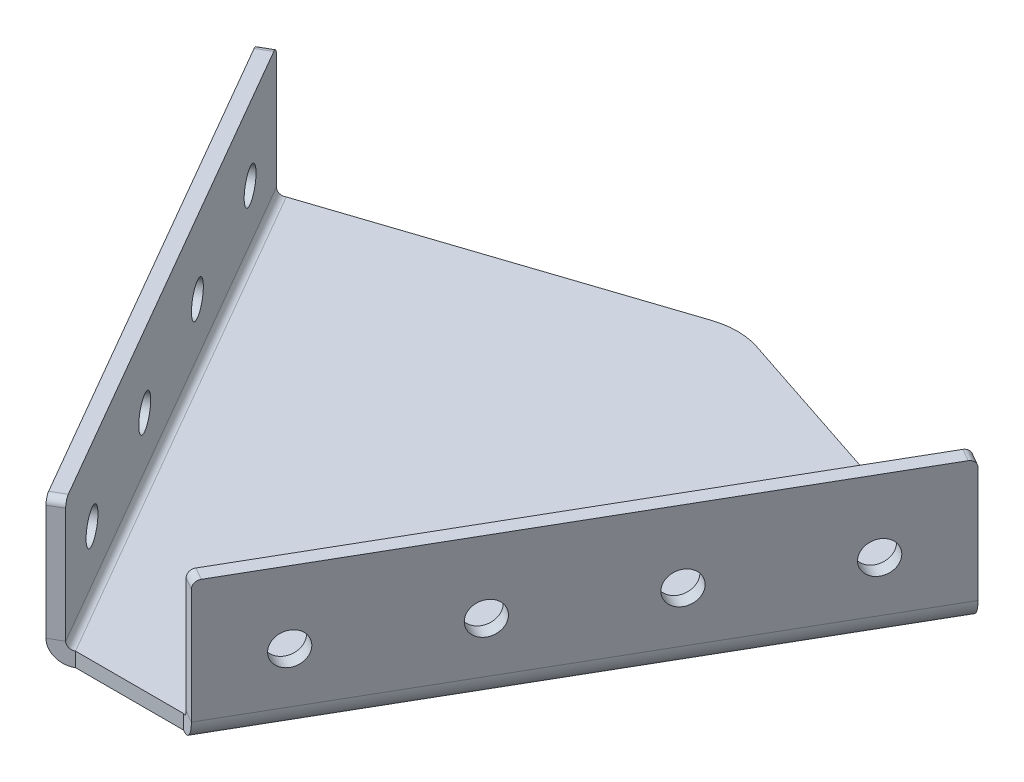
ISO-10303-21;
HEADER;
FILE_DESCRIPTION(('STEP AP214'),'2;1');
FILE_NAME('part.step','',(''),(''),'','','');
FILE_SCHEMA(('AUTOMOTIVE_DESIGN { 1 0 10303 214 1 1 1 1 }'));
ENDSEC;
DATA;
#1=APPLICATION_CONTEXT('core data for automotive mechanical design processes');
#2=APPLICATION_PROTOCOL_DEFINITION('international standard','automotive_design',2000,#1);
#3=PRODUCT_CONTEXT('',#1,'mechanical');
#4=PRODUCT('Part','Part','',(#3));
#5=PRODUCT_RELATED_PRODUCT_CATEGORY('part','',(#4));
#6=PRODUCT_DEFINITION_FORMATION('','',#4);
#7=PRODUCT_DEFINITION_CONTEXT('part definition',#1,'design');
#8=PRODUCT_DEFINITION('design','',#6,#7);
#9=PRODUCT_DEFINITION_SHAPE('','',#8);
#10=(LENGTH_UNIT() NAMED_UNIT(*) SI_UNIT(.MILLI.,.METRE.));
#11=(NAMED_UNIT(*) PLANE_ANGLE_UNIT() SI_UNIT($,.RADIAN.));
#12=(NAMED_UNIT(*) SI_UNIT($,.STERADIAN.) SOLID_ANGLE_UNIT());
#13=UNCERTAINTY_MEASURE_WITH_UNIT(LENGTH_MEASURE(1.E-05),#10,'distance_accuracy_value','');
#14=(GEOMETRIC_REPRESENTATION_CONTEXT(3) GLOBAL_UNCERTAINTY_ASSIGNED_CONTEXT((#13)) GLOBAL_UNIT_ASSIGNED_CONTEXT((#10,
#11,#12)) REPRESENTATION_CONTEXT('',''));
#15=CARTESIAN_POINT('',(0.,0.,0.));
#16=DIRECTION('',(0.,0.,1.));
#17=DIRECTION('',(1.,0.,0.));
#18=AXIS2_PLACEMENT_3D('',#15,#16,#17);
#19=CARTESIAN_POINT('',(95.0767084493342,-13.2391601562485,-55.5973349576684));
#20=DIRECTION('',(-0.314151799048904,0.,0.949372765121444));
#21=DIRECTION('',(-0.949372765121444,0.,-0.314151799048904));
#22=AXIS2_PLACEMENT_3D('',#19,#20,#21);
#23=PLANE('',#22);
#24=DIRECTION('',(-0.949372765121444,0.,-0.314151799048904));
#25=VECTOR('',#24,1.);
#26=CARTESIAN_POINT('',(95.0767084493342,-17.2391601562485,-55.5973349576684));
#27=LINE('',#26,#25);
#28=CARTESIAN_POINT('',(95.0767084493341,-17.2391601562485,-55.5973349576684));
#29=VERTEX_POINT('',#28);
#30=CARTESIAN_POINT('',(6.35974443031255,-17.2391601562485,-84.9541849502709));
#31=VERTEX_POINT('',#30);
#32=EDGE_CURVE('E259',#29,#31,#27,.T.);
#33=ORIENTED_EDGE('',*,*,#32,.T.);
#34=DIRECTION('',(0.,-1.,0.));
#35=VECTOR('',#34,1.);
#36=CARTESIAN_POINT('',(6.35974443031256,-13.2391601562485,-84.9541849502709));
#37=LINE('',#36,#35);
#38=CARTESIAN_POINT('',(6.35974443031255,-13.2391601562485,-84.9541849502709));
#39=VERTEX_POINT('',#38);
#40=EDGE_CURVE('E272',#31,#39,#37,.F.);
#41=ORIENTED_EDGE('',*,*,#40,.T.);
#42=DIRECTION('',(-0.949372765121444,0.,-0.314151799048904));
#43=VECTOR('',#42,1.);
#44=CARTESIAN_POINT('',(95.0767084493342,-13.2391601562485,-55.5973349576684));
#45=LINE('',#44,#43);
#46=CARTESIAN_POINT('',(95.0767084493342,-13.2391601562485,-55.5973349576684));
#47=VERTEX_POINT('',#46);
#48=EDGE_CURVE('E249',#47,#39,#45,.T.);
#49=ORIENTED_EDGE('',*,*,#48,.F.);
#50=DIRECTION('',(0.,1.,0.));
#51=VECTOR('',#50,1.);
#52=CARTESIAN_POINT('',(95.0767084493342,-13.2391601562485,-55.5973349576684));
#53=LINE('',#52,#51);
#54=EDGE_CURVE('E268',#29,#47,#53,.T.);
#55=ORIENTED_EDGE('',*,*,#54,.F.);
#56=EDGE_LOOP('',(#33,#41,#49,#55));
#57=FACE_BOUND('',#56,.T.);
#58=ADVANCED_FACE('F16',(#57),#23,.F.);
#59=CARTESIAN_POINT('',(0.0767084493344949,-13.2391601562485,-87.0332703521581));
#60=DIRECTION('',(0.314151799048904,0.,0.949372765121445));
#61=DIRECTION('',(-0.949372765121444,0.,0.314151799048904));
#62=AXIS2_PLACEMENT_3D('',#59,#60,#61);
#63=PLANE('',#62);
#64=DIRECTION('',(-0.949372765121444,0.,0.314151799048904));
#65=VECTOR('',#64,1.);
#66=CARTESIAN_POINT('',(0.0767084493344949,-13.2391601562485,-87.0332703521581));
#67=LINE('',#66,#65);
#68=CARTESIAN_POINT('',(-6.20632753164357,-13.2391601562485,-84.9541849502709));
#69=VERTEX_POINT('',#68);
#70=CARTESIAN_POINT('',(-94.9232915506651,-13.2391601562485,-55.5973349576684));
#71=VERTEX_POINT('',#70);
#72=EDGE_CURVE('E252',#69,#71,#67,.T.);
#73=ORIENTED_EDGE('',*,*,#72,.F.);
#74=DIRECTION('',(0.,-1.,0.));
#75=VECTOR('',#74,1.);
#76=CARTESIAN_POINT('',(-6.20632753164357,-13.2391601562485,-84.9541849502709));
#77=LINE('',#76,#75);
#78=CARTESIAN_POINT('',(-6.20632753164357,-17.2391601562485,-84.9541849502709));
#79=VERTEX_POINT('',#78);
#80=EDGE_CURVE('E279',#69,#79,#77,.T.);
#81=ORIENTED_EDGE('',*,*,#80,.T.);
#82=DIRECTION('',(-0.949372765121444,0.,0.314151799048904));
#83=VECTOR('',#82,1.);
#84=CARTESIAN_POINT('',(0.0767084493344949,-17.2391601562485,-87.0332703521581));
#85=LINE('',#84,#83);
#86=CARTESIAN_POINT('',(-94.9232915506651,-17.2391601562485,-55.5973349576684));
#87=VERTEX_POINT('',#86);
#88=EDGE_CURVE('E244',#79,#87,#85,.T.);
#89=ORIENTED_EDGE('',*,*,#88,.T.);
#90=DIRECTION('',(0.,1.,0.));
#91=VECTOR('',#90,1.);
#92=CARTESIAN_POINT('',(-94.9232915506651,-13.2391601562485,-55.5973349576684));
#93=LINE('',#92,#91);
#94=EDGE_CURVE('E265',#87,#71,#93,.T.);
#95=ORIENTED_EDGE('',*,*,#94,.T.);
#96=EDGE_LOOP('',(#73,#81,#89,#95));
#97=FACE_BOUND('',#96,.T.);
#98=ADVANCED_FACE('F389',(#97),#63,.F.);
#99=CARTESIAN_POINT('',(-14.9232915506655,-13.2391601562485,82.9667296478419));
#100=DIRECTION('',(0.,0.,-1.));
#101=DIRECTION('',(1.,0.,0.));
#102=AXIS2_PLACEMENT_3D('',#99,#100,#101);
#103=PLANE('',#102);
#104=DIRECTION('',(1.,0.,0.));
#105=VECTOR('',#104,1.);
#106=CARTESIAN_POINT('',(0.0767084493344949,-17.2391601562485,82.9667296478419));
#107=LINE('',#106,#105);
#108=CARTESIAN_POINT('',(-14.9232915506655,-17.2391601562484,82.966729647842));
#109=VERTEX_POINT('',#108);
#110=CARTESIAN_POINT('',(15.0767084493345,-17.2391601562485,82.9667296478419));
#111=VERTEX_POINT('',#110);
#112=EDGE_CURVE('E257',#109,#111,#107,.T.);
#113=ORIENTED_EDGE('',*,*,#112,.T.);
#114=DIRECTION('',(0.,1.,0.));
#115=VECTOR('',#114,1.);
#116=CARTESIAN_POINT('',(15.0767084493345,-13.2391601562485,82.9667296478419));
#117=LINE('',#116,#115);
#118=CARTESIAN_POINT('',(15.0767084493345,-13.2391601562485,82.9667296478419));
#119=VERTEX_POINT('',#118);
#120=EDGE_CURVE('E270',#111,#119,#117,.T.);
#121=ORIENTED_EDGE('',*,*,#120,.T.);
#122=DIRECTION('',(1.,0.,0.));
#123=VECTOR('',#122,1.);
#124=CARTESIAN_POINT('',(-14.9232915506655,-13.2391601562485,82.9667296478419));
#125=LINE('',#124,#123);
#126=CARTESIAN_POINT('',(-14.9232915506655,-13.2391601562485,82.9667296478419));
#127=VERTEX_POINT('',#126);
#128=EDGE_CURVE('E243',#127,#119,#125,.T.);
#129=ORIENTED_EDGE('',*,*,#128,.F.);
#130=DIRECTION('',(0.,1.,0.));
#131=VECTOR('',#130,1.);
#132=CARTESIAN_POINT('',(-14.9232915506655,-13.2391601562485,82.9667296478419));
#133=LINE('',#132,#131);
#134=EDGE_CURVE('E254',#109,#127,#133,.T.);
#135=ORIENTED_EDGE('',*,*,#134,.F.);
#136=EDGE_LOOP('',(#113,#121,#129,#135));
#137=FACE_BOUND('',#136,.T.);
#138=ADVANCED_FACE('F352',(#137),#103,.F.);
#139=CARTESIAN_POINT('',(0.0767084493344949,-13.2391601562485,82.9667296478419));
#140=DIRECTION('',(0.,-1.,0.));
#141=DIRECTION('',(0.,0.,-1.));
#142=AXIS2_PLACEMENT_3D('',#139,#140,#141);
#143=PLANE('',#142);
#144=ORIENTED_EDGE('',*,*,#48,.T.);
#145=CARTESIAN_POINT('',(0.0767084493345088,-13.2391601562485,-65.966729647842));
#146=DIRECTION('',(0.,-1.,0.));
#147=DIRECTION('',(0.,0.,-1.));
#148=AXIS2_PLACEMENT_3D('',#145,#146,#147);
#149=CIRCLE('',#148,20.);
#150=EDGE_CURVE('E277',#39,#69,#149,.F.);
#151=ORIENTED_EDGE('',*,*,#150,.T.);
#152=ORIENTED_EDGE('',*,*,#72,.T.);
#153=DIRECTION('',(0.499999999999998,0.,0.86602540378444));
#154=VECTOR('',#153,1.);
#155=CARTESIAN_POINT('',(-94.9232915506651,-13.2391601562485,-55.5973349576684));
#156=LINE('',#155,#154);
#157=EDGE_CURVE('E241',#71,#127,#156,.T.);
#158=ORIENTED_EDGE('',*,*,#157,.T.);
#159=ORIENTED_EDGE('',*,*,#128,.T.);
#160=DIRECTION('',(0.499999999999998,0.,-0.86602540378444));
#161=VECTOR('',#160,1.);
#162=CARTESIAN_POINT('',(15.0767084493345,-13.2391601562485,82.9667296478419));
#163=LINE('',#162,#161);
#164=EDGE_CURVE('E247',#119,#47,#163,.T.);
#165=ORIENTED_EDGE('',*,*,#164,.T.);
#166=EDGE_LOOP('',(#144,#151,#152,#158,#159,#165));
#167=FACE_BOUND('',#166,.T.);
#168=ADVANCED_FACE('F347',(#167),#143,.F.);
#169=CARTESIAN_POINT('',(0.0767084493344949,-17.2391601562485,82.9667296478419));
#170=DIRECTION('',(0.,-1.,0.));
#171=DIRECTION('',(0.,0.,-1.));
#172=AXIS2_PLACEMENT_3D('',#169,#170,#171);
#173=PLANE('',#172);
#174=ORIENTED_EDGE('',*,*,#88,.F.);
#175=CARTESIAN_POINT('',(0.0767084493345088,-17.2391601562485,-65.966729647842));
#176=DIRECTION('',(0.,-1.,0.));
#177=DIRECTION('',(0.,0.,-1.));
#178=AXIS2_PLACEMENT_3D('',#175,#176,#177);
#179=CIRCLE('',#178,20.);
#180=EDGE_CURVE('E281',#79,#31,#179,.T.);
#181=ORIENTED_EDGE('',*,*,#180,.T.);
#182=ORIENTED_EDGE('',*,*,#32,.F.);
#183=DIRECTION('',(0.499999999999998,0.,-0.86602540378444));
#184=VECTOR('',#183,1.);
#185=CARTESIAN_POINT('',(15.0767084493345,-17.2391601562485,82.9667296478419));
#186=LINE('',#185,#184);
#187=EDGE_CURVE('E152',#111,#29,#186,.T.);
#188=ORIENTED_EDGE('',*,*,#187,.F.);
#189=ORIENTED_EDGE('',*,*,#112,.F.);
#190=DIRECTION('',(0.499999999999998,0.,0.86602540378444));
#191=VECTOR('',#190,1.);
#192=CARTESIAN_POINT('',(-94.9232915506651,-17.2391601562485,-55.5973349576684));
#193=LINE('',#192,#191);
#194=EDGE_CURVE('E232',#87,#109,#193,.T.);
#195=ORIENTED_EDGE('',*,*,#194,.F.);
#196=EDGE_LOOP('',(#174,#181,#182,#188,#189,#195));
#197=FACE_BOUND('',#196,.T.);
#198=ADVANCED_FACE('F607',(#197),#173,.T.);
#199=CARTESIAN_POINT('',(-94.9232915506652,-11.2391601562485,-55.5973349576684));
#200=DIRECTION('',(-0.499999999999998,0.,-0.86602540378444));
#201=DIRECTION('',(-0.86602540378444,0.,0.499999999999998));
#202=AXIS2_PLACEMENT_3D('',#199,#200,#201);
#203=PLANE('',#202);
#204=DIRECTION('',(0.86602540378444,0.,-0.499999999999998));
#205=VECTOR('',#204,1.);
#206=CARTESIAN_POINT('',(-100.119443973372,-11.2391601562485,-52.5973349576684));
#207=LINE('',#206,#205);
#208=CARTESIAN_POINT('',(-96.6553423582341,-11.2391601562485,-54.5973349576684));
#209=VERTEX_POINT('',#208);
#210=CARTESIAN_POINT('',(-100.119443973372,-11.2391601562485,-52.5973349576685));
#211=VERTEX_POINT('',#210);
#212=EDGE_CURVE('E200',#209,#211,#207,.F.);
#213=ORIENTED_EDGE('',*,*,#212,.F.);
#214=CARTESIAN_POINT('',(-94.9232915506652,-11.2391601562485,-55.5973349576684));
#215=DIRECTION('',(0.499999999999998,0.,0.86602540378444));
#216=DIRECTION('',(0.86602540378444,0.,-0.499999999999998));
#217=AXIS2_PLACEMENT_3D('',#214,#215,#216);
#218=CIRCLE('',#217,1.99999999999998);
#219=EDGE_CURVE('E236',#71,#209,#218,.F.);
#220=ORIENTED_EDGE('',*,*,#219,.F.);
#221=ORIENTED_EDGE('',*,*,#94,.F.);
#222=CARTESIAN_POINT('',(-94.9232915506652,-11.2391601562485,-55.5973349576684));
#223=DIRECTION('',(0.499999999999998,0.,0.86602540378444));
#224=DIRECTION('',(0.86602540378444,0.,-0.499999999999998));
#225=AXIS2_PLACEMENT_3D('',#222,#223,#224);
#226=CIRCLE('',#225,5.99999999999998);
#227=EDGE_CURVE('E229',#87,#211,#226,.F.);
#228=ORIENTED_EDGE('',*,*,#227,.T.);
#229=EDGE_LOOP('',(#213,#220,#221,#228));
#230=FACE_BOUND('',#229,.T.);
#231=ADVANCED_FACE('F336',(#230),#203,.T.);
#232=CARTESIAN_POINT('',(-14.9232915506655,-11.2391601562485,82.9667296478419));
#233=DIRECTION('',(-0.499999999999998,0.,-0.86602540378444));
#234=DIRECTION('',(-0.86602540378444,0.,0.499999999999998));
#235=AXIS2_PLACEMENT_3D('',#232,#233,#234);
#236=PLANE('',#235);
#237=CARTESIAN_POINT('',(-14.9232915506655,-11.2391601562485,82.9667296478419));
#238=DIRECTION('',(0.499999999999998,0.,0.86602540378444));
#239=DIRECTION('',(0.86602540378444,0.,-0.499999999999998));
#240=AXIS2_PLACEMENT_3D('',#237,#238,#239);
#241=CIRCLE('',#240,1.99999999999998);
#242=CARTESIAN_POINT('',(-16.6553423582344,-11.2391601562485,83.9667296478419));
#243=VERTEX_POINT('',#242);
#244=EDGE_CURVE('E207',#243,#127,#241,.T.);
#245=ORIENTED_EDGE('',*,*,#244,.F.);
#246=DIRECTION('',(0.86602540378444,0.,-0.499999999999998));
#247=VECTOR('',#246,1.);
#248=CARTESIAN_POINT('',(-16.6553423582344,-11.2391601562485,83.966729647842));
#249=LINE('',#248,#247);
#250=CARTESIAN_POINT('',(-20.1194439733721,-11.2391601562485,85.9667296478419));
#251=VERTEX_POINT('',#250);
#252=EDGE_CURVE('E222',#243,#251,#249,.F.);
#253=ORIENTED_EDGE('',*,*,#252,.T.);
#254=CARTESIAN_POINT('',(-14.9232915506655,-11.2391601562485,82.9667296478419));
#255=DIRECTION('',(0.499999999999998,0.,0.86602540378444));
#256=DIRECTION('',(0.86602540378444,0.,-0.499999999999998));
#257=AXIS2_PLACEMENT_3D('',#254,#255,#256);
#258=CIRCLE('',#257,5.99999999999998);
#259=EDGE_CURVE('E233',#251,#109,#258,.T.);
#260=ORIENTED_EDGE('',*,*,#259,.T.);
#261=ORIENTED_EDGE('',*,*,#134,.T.);
#262=EDGE_LOOP('',(#245,#253,#260,#261));
#263=FACE_BOUND('',#262,.T.);
#264=ADVANCED_FACE('F329',(#263),#236,.F.);
#265=CARTESIAN_POINT('',(-14.9232915506655,-11.2391601562485,82.9667296478419));
#266=DIRECTION('',(0.499999999999998,0.,0.86602540378444));
#267=DIRECTION('',(-0.86602540378444,0.,0.499999999999998));
#268=AXIS2_PLACEMENT_3D('',#265,#266,#267);
#269=CYLINDRICAL_SURFACE('',#268,5.99999999999998);
#270=ORIENTED_EDGE('',*,*,#194,.T.);
#271=ORIENTED_EDGE('',*,*,#259,.F.);
#272=DIRECTION('',(0.499999999999998,0.,0.86602540378444));
#273=VECTOR('',#272,1.);
#274=CARTESIAN_POINT('',(-100.119443973372,-11.2391601562485,-52.5973349576684));
#275=LINE('',#274,#273);
#276=EDGE_CURVE('E219',#251,#211,#275,.F.);
#277=ORIENTED_EDGE('',*,*,#276,.T.);
#278=ORIENTED_EDGE('',*,*,#227,.F.);
#279=EDGE_LOOP('',(#270,#271,#277,#278));
#280=FACE_BOUND('',#279,.T.);
#281=ADVANCED_FACE('F332',(#280),#269,.T.);
#282=CARTESIAN_POINT('',(-14.9232915506655,-11.2391601562485,82.9667296478419));
#283=DIRECTION('',(0.499999999999998,0.,0.86602540378444));
#284=DIRECTION('',(-0.86602540378444,0.,0.499999999999998));
#285=AXIS2_PLACEMENT_3D('',#282,#283,#284);
#286=CYLINDRICAL_SURFACE('',#285,1.99999999999998);
#287=ORIENTED_EDGE('',*,*,#157,.F.);
#288=ORIENTED_EDGE('',*,*,#219,.T.);
#289=DIRECTION('',(0.499999999999998,0.,0.86602540378444));
#290=VECTOR('',#289,1.);
#291=CARTESIAN_POINT('',(-96.6553423582341,-11.2391601562485,-54.5973349576684));
#292=LINE('',#291,#290);
#293=EDGE_CURVE('E225',#209,#243,#292,.T.);
#294=ORIENTED_EDGE('',*,*,#293,.T.);
#295=ORIENTED_EDGE('',*,*,#244,.T.);
#296=EDGE_LOOP('',(#287,#288,#294,#295));
#297=FACE_BOUND('',#296,.T.);
#298=ADVANCED_FACE('F344',(#297),#286,.F.);
#299=CARTESIAN_POINT('',(-20.1194439733723,22.7608398437485,85.966729647842));
#300=DIRECTION('',(-0.499999999999998,0.,-0.86602540378444));
#301=DIRECTION('',(-0.86602540378444,0.,0.499999999999998));
#302=AXIS2_PLACEMENT_3D('',#299,#300,#301);
#303=PLANE('',#302);
#304=DIRECTION('',(0.,-1.,0.));
#305=VECTOR('',#304,1.);
#306=CARTESIAN_POINT('',(-16.6553423582345,22.7608398437485,83.966729647842));
#307=LINE('',#306,#305);
#308=CARTESIAN_POINT('',(-16.6553423582345,20.7608398437485,83.966729647842));
#309=VERTEX_POINT('',#308);
#310=EDGE_CURVE('E217',#243,#309,#307,.F.);
#311=ORIENTED_EDGE('',*,*,#310,.T.);
#312=DIRECTION('',(0.86602540378444,0.,-0.499999999999998));
#313=VECTOR('',#312,1.);
#314=CARTESIAN_POINT('',(-20.1194439733722,20.7608398437485,85.966729647842));
#315=LINE('',#314,#313);
#316=CARTESIAN_POINT('',(-20.1194439733723,20.7608398437485,85.966729647842));
#317=VERTEX_POINT('',#316);
#318=EDGE_CURVE('E39',#309,#317,#315,.F.);
#319=ORIENTED_EDGE('',*,*,#318,.T.);
#320=DIRECTION('',(0.,1.,0.));
#321=VECTOR('',#320,1.);
#322=CARTESIAN_POINT('',(-20.1194439733721,-17.2391601562485,85.9667296478419));
#323=LINE('',#322,#321);
#324=EDGE_CURVE('E210',#251,#317,#323,.T.);
#325=ORIENTED_EDGE('',*,*,#324,.F.);
#326=ORIENTED_EDGE('',*,*,#252,.F.);
#327=EDGE_LOOP('',(#311,#319,#325,#326));
#328=FACE_BOUND('',#327,.T.);
#329=ADVANCED_FACE('F326',(#328),#303,.F.);
#330=CARTESIAN_POINT('',(-100.119443973372,-13.2391601562485,-52.5973349576684));
#331=DIRECTION('',(0.499999999999998,0.,0.86602540378444));
#332=DIRECTION('',(0.86602540378444,0.,-0.499999999999998));
#333=AXIS2_PLACEMENT_3D('',#330,#331,#332);
#334=PLANE('',#333);
#335=DIRECTION('',(0.,-1.,0.));
#336=VECTOR('',#335,1.);
#337=CARTESIAN_POINT('',(-100.119443973372,-17.2391601562486,-52.5973349576684));
#338=LINE('',#337,#336);
#339=CARTESIAN_POINT('',(-100.119443973372,20.7608398437485,-52.5973349576684));
#340=VERTEX_POINT('',#339);
#341=EDGE_CURVE('E205',#340,#211,#338,.T.);
#342=ORIENTED_EDGE('',*,*,#341,.F.);
#343=DIRECTION('',(0.86602540378444,0.,-0.499999999999998));
#344=VECTOR('',#343,1.);
#345=CARTESIAN_POINT('',(-100.119443973372,20.7608398437485,-52.5973349576684));
#346=LINE('',#345,#344);
#347=CARTESIAN_POINT('',(-96.6553423582341,20.7608398437485,-54.5973349576684));
#348=VERTEX_POINT('',#347);
#349=EDGE_CURVE('E10',#340,#348,#346,.T.);
#350=ORIENTED_EDGE('',*,*,#349,.T.);
#351=DIRECTION('',(0.,1.,0.));
#352=VECTOR('',#351,1.);
#353=CARTESIAN_POINT('',(-96.655342358234,-13.2391601562485,-54.5973349576684));
#354=LINE('',#353,#352);
#355=EDGE_CURVE('E212',#348,#209,#354,.F.);
#356=ORIENTED_EDGE('',*,*,#355,.T.);
#357=ORIENTED_EDGE('',*,*,#212,.T.);
#358=EDGE_LOOP('',(#342,#350,#356,#357));
#359=FACE_BOUND('',#358,.T.);
#360=ADVANCED_FACE('F339',(#359),#334,.F.);
#361=CARTESIAN_POINT('',(-16.3694439733722,-17.2391601562485,92.4619201762252));
#362=DIRECTION('',(0.86602540378444,0.,-0.499999999999998));
#363=DIRECTION('',(-0.499999999999998,0.,-0.86602540378444));
#364=AXIS2_PLACEMENT_3D('',#361,#362,#363);
#365=PLANE('',#364);
#366=CARTESIAN_POINT('',(-70.1194439733719,2.76083984374994,-0.635810730601968));
#367=DIRECTION('',(-0.86602540378444,0.,0.499999999999998));
#368=DIRECTION('',(0.499999999999998,0.,0.86602540378444));
#369=AXIS2_PLACEMENT_3D('',#366,#367,#368);
#370=CIRCLE('',#369,4.5);
#371=CARTESIAN_POINT('',(-67.869443973372,2.76083984374994,3.26130358642801));
#372=VERTEX_POINT('',#371);
#373=EDGE_CURVE('E561',#372,#372,#370,.T.);
#374=ORIENTED_EDGE('',*,*,#373,.F.);
#375=EDGE_LOOP('',(#374));
#376=FACE_BOUND('',#375,.T.);
#377=CARTESIAN_POINT('',(-50.119443973372,2.76083984375002,34.0052054207756));
#378=DIRECTION('',(-0.86602540378444,0.,0.499999999999998));
#379=DIRECTION('',(0.499999999999998,0.,0.86602540378444));
#380=AXIS2_PLACEMENT_3D('',#377,#378,#379);
#381=CIRCLE('',#380,4.5);
#382=CARTESIAN_POINT('',(-47.869443973372,2.76083984375002,37.9023197378056));
#383=VERTEX_POINT('',#382);
#384=EDGE_CURVE('E569',#383,#383,#381,.T.);
#385=ORIENTED_EDGE('',*,*,#384,.F.);
#386=EDGE_LOOP('',(#385));
#387=FACE_BOUND('',#386,.T.);
#388=CARTESIAN_POINT('',(-30.1194439733721,2.7608398437501,68.6462215721532));
#389=DIRECTION('',(-0.86602540378444,0.,0.499999999999998));
#390=DIRECTION('',(0.499999999999998,0.,0.86602540378444));
#391=AXIS2_PLACEMENT_3D('',#388,#389,#390);
#392=CIRCLE('',#391,4.50000000000002);
#393=CARTESIAN_POINT('',(-27.8694439733721,2.7608398437501,72.5433358891832));
#394=VERTEX_POINT('',#393);
#395=EDGE_CURVE('E560',#394,#394,#392,.T.);
#396=ORIENTED_EDGE('',*,*,#395,.F.);
#397=EDGE_LOOP('',(#396));
#398=FACE_BOUND('',#397,.T.);
#399=CARTESIAN_POINT('',(-90.1194439733719,2.76083984374986,-35.2768268819796));
#400=DIRECTION('',(-0.86602540378444,0.,0.499999999999998));
#401=DIRECTION('',(0.499999999999998,0.,0.86602540378444));
#402=AXIS2_PLACEMENT_3D('',#399,#400,#401);
#403=CIRCLE('',#402,4.49999999999999);
#404=CARTESIAN_POINT('',(-87.8694439733719,2.76083984374986,-31.3797125649496));
#405=VERTEX_POINT('',#404);
#406=EDGE_CURVE('E568',#405,#405,#403,.T.);
#407=ORIENTED_EDGE('',*,*,#406,.F.);
#408=EDGE_LOOP('',(#407));
#409=FACE_BOUND('',#408,.T.);
#410=ORIENTED_EDGE('',*,*,#324,.T.);
#411=CARTESIAN_POINT('',(-21.1194439733722,20.7608398437485,84.2346788402731));
#412=DIRECTION('',(0.86602540378444,0.,-0.499999999999998));
#413=DIRECTION('',(-0.499999999999998,0.,-0.86602540378444));
#414=AXIS2_PLACEMENT_3D('',#411,#412,#413);
#415=CIRCLE('',#414,2.);
#416=CARTESIAN_POINT('',(-21.1194439733723,22.7608398437485,84.2346788402731));
#417=VERTEX_POINT('',#416);
#418=EDGE_CURVE('E24',#317,#417,#415,.F.);
#419=ORIENTED_EDGE('',*,*,#418,.T.);
#420=DIRECTION('',(-0.499999999999998,0.,-0.86602540378444));
#421=VECTOR('',#420,1.);
#422=CARTESIAN_POINT('',(-16.3694439733723,22.7608398437485,92.4619201762253));
#423=LINE('',#422,#421);
#424=CARTESIAN_POINT('',(-99.1194439733719,22.7608398437485,-50.8652841500995));
#425=VERTEX_POINT('',#424);
#426=EDGE_CURVE('E208',#417,#425,#423,.T.);
#427=ORIENTED_EDGE('',*,*,#426,.T.);
#428=CARTESIAN_POINT('',(-99.1194439733719,20.7608398437485,-50.8652841500995));
#429=DIRECTION('',(0.86602540378444,0.,-0.499999999999998));
#430=DIRECTION('',(-0.499999999999998,0.,-0.86602540378444));
#431=AXIS2_PLACEMENT_3D('',#428,#429,#430);
#432=CIRCLE('',#431,2.);
#433=EDGE_CURVE('E31',#425,#340,#432,.F.);
#434=ORIENTED_EDGE('',*,*,#433,.T.);
#435=ORIENTED_EDGE('',*,*,#341,.T.);
#436=ORIENTED_EDGE('',*,*,#276,.F.);
#437=EDGE_LOOP('',(#410,#419,#427,#434,#435,#436));
#438=FACE_BOUND('',#437,.T.);
#439=ADVANCED_FACE('F312',(#376,#387,#398,#409,#438),#365,.F.);
#440=CARTESIAN_POINT('',(-12.9053423582344,-17.2391601562485,90.4619201762252));
#441=DIRECTION('',(0.86602540378444,0.,-0.499999999999998));
#442=DIRECTION('',(-0.499999999999998,0.,-0.86602540378444));
#443=AXIS2_PLACEMENT_3D('',#440,#441,#442);
#444=PLANE('',#443);
#445=CARTESIAN_POINT('',(-66.6553423582342,2.76083984374996,-2.63581073060196));
#446=DIRECTION('',(0.86602540378444,0.,-0.499999999999998));
#447=DIRECTION('',(-0.499999999999998,0.,-0.86602540378444));
#448=AXIS2_PLACEMENT_3D('',#445,#446,#447);
#449=CIRCLE('',#448,4.5);
#450=CARTESIAN_POINT('',(-68.9053423582342,2.76083984374996,-6.53292504763194));
#451=VERTEX_POINT('',#450);
#452=EDGE_CURVE('E564',#451,#451,#449,.F.);
#453=ORIENTED_EDGE('',*,*,#452,.T.);
#454=EDGE_LOOP('',(#453));
#455=FACE_BOUND('',#454,.T.);
#456=CARTESIAN_POINT('',(-46.6553423582343,2.76083984375004,32.0052054207756));
#457=DIRECTION('',(0.86602540378444,0.,-0.499999999999998));
#458=DIRECTION('',(-0.499999999999998,0.,-0.86602540378444));
#459=AXIS2_PLACEMENT_3D('',#456,#457,#458);
#460=CIRCLE('',#459,4.5);
#461=CARTESIAN_POINT('',(-48.9053423582343,2.76083984375004,28.1080911037457));
#462=VERTEX_POINT('',#461);
#463=EDGE_CURVE('E565',#462,#462,#460,.F.);
#464=ORIENTED_EDGE('',*,*,#463,.T.);
#465=EDGE_LOOP('',(#464));
#466=FACE_BOUND('',#465,.T.);
#467=CARTESIAN_POINT('',(-26.6553423582344,2.76083984375012,66.6462215721532));
#468=DIRECTION('',(0.86602540378444,0.,-0.499999999999998));
#469=DIRECTION('',(-0.499999999999998,0.,-0.86602540378444));
#470=AXIS2_PLACEMENT_3D('',#467,#468,#469);
#471=CIRCLE('',#470,4.50000000000002);
#472=CARTESIAN_POINT('',(-28.9053423582344,2.76083984375012,62.7491072551232));
#473=VERTEX_POINT('',#472);
#474=EDGE_CURVE('E572',#473,#473,#471,.F.);
#475=ORIENTED_EDGE('',*,*,#474,.T.);
#476=EDGE_LOOP('',(#475));
#477=FACE_BOUND('',#476,.T.);
#478=CARTESIAN_POINT('',(-86.6553423582341,2.76083984374987,-37.2768268819796));
#479=DIRECTION('',(0.86602540378444,0.,-0.499999999999998));
#480=DIRECTION('',(-0.499999999999998,0.,-0.86602540378444));
#481=AXIS2_PLACEMENT_3D('',#478,#479,#480);
#482=CIRCLE('',#481,4.49999999999999);
#483=CARTESIAN_POINT('',(-88.9053423582341,2.76083984374987,-41.1739411990095));
#484=VERTEX_POINT('',#483);
#485=EDGE_CURVE('E199',#484,#484,#482,.F.);
#486=ORIENTED_EDGE('',*,*,#485,.T.);
#487=EDGE_LOOP('',(#486));
#488=FACE_BOUND('',#487,.T.);
#489=DIRECTION('',(0.499999999999998,0.,0.86602540378444));
#490=VECTOR('',#489,1.);
#491=CARTESIAN_POINT('',(-96.6553423582341,22.7608398437485,-54.5973349576684));
#492=LINE('',#491,#490);
#493=CARTESIAN_POINT('',(-17.6553423582345,22.7608398437485,82.2346788402731));
#494=VERTEX_POINT('',#493);
#495=CARTESIAN_POINT('',(-95.6553423582341,22.7608398437485,-52.8652841500995));
#496=VERTEX_POINT('',#495);
#497=EDGE_CURVE('E214',#494,#496,#492,.F.);
#498=ORIENTED_EDGE('',*,*,#497,.F.);
#499=CARTESIAN_POINT('',(-17.6553423582345,20.7608398437485,82.2346788402731));
#500=DIRECTION('',(0.86602540378444,0.,-0.499999999999998));
#501=DIRECTION('',(-0.499999999999998,0.,-0.86602540378444));
#502=AXIS2_PLACEMENT_3D('',#499,#500,#501);
#503=CIRCLE('',#502,2.);
#504=EDGE_CURVE('E307',#494,#309,#503,.T.);
#505=ORIENTED_EDGE('',*,*,#504,.T.);
#506=ORIENTED_EDGE('',*,*,#310,.F.);
#507=ORIENTED_EDGE('',*,*,#293,.F.);
#508=ORIENTED_EDGE('',*,*,#355,.F.);
#509=CARTESIAN_POINT('',(-95.6553423582341,20.7608398437485,-52.8652841500995));
#510=DIRECTION('',(0.86602540378444,0.,-0.499999999999998));
#511=DIRECTION('',(-0.499999999999998,0.,-0.86602540378444));
#512=AXIS2_PLACEMENT_3D('',#509,#510,#511);
#513=CIRCLE('',#512,2.);
#514=EDGE_CURVE('E305',#348,#496,#513,.T.);
#515=ORIENTED_EDGE('',*,*,#514,.T.);
#516=EDGE_LOOP('',(#498,#505,#506,#507,#508,#515));
#517=FACE_BOUND('',#516,.T.);
#518=ADVANCED_FACE('F323',(#455,#466,#477,#488,#517),#444,.T.);
#519=CARTESIAN_POINT('',(-100.119443973372,22.7608398437485,-52.5973349576684));
#520=DIRECTION('',(0.,-1.,0.));
#521=DIRECTION('',(1.,0.,0.));
#522=AXIS2_PLACEMENT_3D('',#519,#520,#521);
#523=PLANE('',#522);
#524=ORIENTED_EDGE('',*,*,#426,.F.);
#525=DIRECTION('',(0.86602540378444,0.,-0.499999999999998));
#526=VECTOR('',#525,1.);
#527=CARTESIAN_POINT('',(-21.1194439733723,22.7608398437485,84.2346788402731));
#528=LINE('',#527,#526);
#529=EDGE_CURVE('E302',#417,#494,#528,.T.);
#530=ORIENTED_EDGE('',*,*,#529,.T.);
#531=ORIENTED_EDGE('',*,*,#497,.T.);
#532=DIRECTION('',(0.86602540378444,0.,-0.499999999999998));
#533=VECTOR('',#532,1.);
#534=CARTESIAN_POINT('',(-99.1194439733719,22.7608398437485,-50.8652841500995));
#535=LINE('',#534,#533);
#536=EDGE_CURVE('E300',#496,#425,#535,.F.);
#537=ORIENTED_EDGE('',*,*,#536,.T.);
#538=EDGE_LOOP('',(#524,#530,#531,#537));
#539=FACE_BOUND('',#538,.T.);
#540=ADVANCED_FACE('F317',(#539),#523,.F.);
#541=CARTESIAN_POINT('',(15.0767084493345,-11.2391601562485,82.9667296478419));
#542=DIRECTION('',(-0.499999999999998,0.,0.86602540378444));
#543=DIRECTION('',(0.86602540378444,0.,0.499999999999998));
#544=AXIS2_PLACEMENT_3D('',#541,#542,#543);
#545=PLANE('',#544);
#546=DIRECTION('',(-0.86602540378444,0.,-0.499999999999998));
#547=VECTOR('',#546,1.);
#548=CARTESIAN_POINT('',(20.2728608720411,-11.2391601562485,85.9667296478419));
#549=LINE('',#548,#547);
#550=CARTESIAN_POINT('',(16.8087592569034,-11.2391601562485,83.966729647842));
#551=VERTEX_POINT('',#550);
#552=CARTESIAN_POINT('',(20.2728608720411,-11.2391601562485,85.966729647842));
#553=VERTEX_POINT('',#552);
#554=EDGE_CURVE('E196',#551,#553,#549,.F.);
#555=ORIENTED_EDGE('',*,*,#554,.F.);
#556=CARTESIAN_POINT('',(15.0767084493345,-11.2391601562485,82.9667296478419));
#557=DIRECTION('',(0.499999999999998,0.,-0.86602540378444));
#558=DIRECTION('',(-0.86602540378444,0.,-0.499999999999998));
#559=AXIS2_PLACEMENT_3D('',#556,#557,#558);
#560=CIRCLE('',#559,2.00000000000003);
#561=EDGE_CURVE('E156',#119,#551,#560,.F.);
#562=ORIENTED_EDGE('',*,*,#561,.F.);
#563=ORIENTED_EDGE('',*,*,#120,.F.);
#564=CARTESIAN_POINT('',(15.0767084493345,-11.2391601562485,82.9667296478419));
#565=DIRECTION('',(0.499999999999998,0.,-0.86602540378444));
#566=DIRECTION('',(-0.86602540378444,0.,-0.499999999999998));
#567=AXIS2_PLACEMENT_3D('',#564,#565,#566);
#568=CIRCLE('',#567,6.00000000000003);
#569=EDGE_CURVE('E155',#111,#553,#568,.F.);
#570=ORIENTED_EDGE('',*,*,#569,.T.);
#571=EDGE_LOOP('',(#555,#562,#563,#570));
#572=FACE_BOUND('',#571,.T.);
#573=ADVANCED_FACE('F357',(#572),#545,.T.);
#574=CARTESIAN_POINT('',(95.0767084493342,-11.2391601562485,-55.5973349576684));
#575=DIRECTION('',(-0.499999999999998,0.,0.86602540378444));
#576=DIRECTION('',(0.86602540378444,0.,0.499999999999998));
#577=AXIS2_PLACEMENT_3D('',#574,#575,#576);
#578=PLANE('',#577);
#579=CARTESIAN_POINT('',(95.0767084493342,-11.2391601562485,-55.5973349576684));
#580=DIRECTION('',(0.499999999999998,0.,-0.86602540378444));
#581=DIRECTION('',(-0.86602540378444,0.,-0.499999999999998));
#582=AXIS2_PLACEMENT_3D('',#579,#580,#581);
#583=CIRCLE('',#582,2.00000000000003);
#584=CARTESIAN_POINT('',(96.8087592569031,-11.2391601562485,-54.5973349576684));
#585=VERTEX_POINT('',#584);
#586=EDGE_CURVE('E163',#585,#47,#583,.T.);
#587=ORIENTED_EDGE('',*,*,#586,.F.);
#588=DIRECTION('',(-0.86602540378444,0.,-0.499999999999998));
#589=VECTOR('',#588,1.);
#590=CARTESIAN_POINT('',(96.808759256903,-11.2391601562485,-54.5973349576684));
#591=LINE('',#590,#589);
#592=CARTESIAN_POINT('',(100.272860872041,-11.2391601562485,-52.5973349576684));
#593=VERTEX_POINT('',#592);
#594=EDGE_CURVE('E160',#585,#593,#591,.F.);
#595=ORIENTED_EDGE('',*,*,#594,.T.);
#596=CARTESIAN_POINT('',(95.0767084493342,-11.2391601562485,-55.5973349576684));
#597=DIRECTION('',(0.499999999999998,0.,-0.86602540378444));
#598=DIRECTION('',(-0.86602540378444,0.,-0.499999999999998));
#599=AXIS2_PLACEMENT_3D('',#596,#597,#598);
#600=CIRCLE('',#599,6.00000000000003);
#601=EDGE_CURVE('E145',#593,#29,#600,.T.);
#602=ORIENTED_EDGE('',*,*,#601,.T.);
#603=ORIENTED_EDGE('',*,*,#54,.T.);
#604=EDGE_LOOP('',(#587,#595,#602,#603));
#605=FACE_BOUND('',#604,.T.);
#606=ADVANCED_FACE('F161',(#605),#578,.F.);
#607=CARTESIAN_POINT('',(95.0767084493342,-11.2391601562485,-55.5973349576684));
#608=DIRECTION('',(0.499999999999998,0.,-0.86602540378444));
#609=DIRECTION('',(0.86602540378444,0.,0.499999999999998));
#610=AXIS2_PLACEMENT_3D('',#607,#608,#609);
#611=CYLINDRICAL_SURFACE('',#610,6.00000000000003);
#612=ORIENTED_EDGE('',*,*,#187,.T.);
#613=ORIENTED_EDGE('',*,*,#601,.F.);
#614=DIRECTION('',(0.499999999999998,0.,-0.86602540378444));
#615=VECTOR('',#614,1.);
#616=CARTESIAN_POINT('',(20.2728608720411,-11.2391601562485,85.9667296478419));
#617=LINE('',#616,#615);
#618=EDGE_CURVE('E150',#593,#553,#617,.F.);
#619=ORIENTED_EDGE('',*,*,#618,.T.);
#620=ORIENTED_EDGE('',*,*,#569,.F.);
#621=EDGE_LOOP('',(#612,#613,#619,#620));
#622=FACE_BOUND('',#621,.T.);
#623=ADVANCED_FACE('F147',(#622),#611,.T.);
#624=CARTESIAN_POINT('',(95.0767084493342,-11.2391601562485,-55.5973349576684));
#625=DIRECTION('',(0.499999999999998,0.,-0.86602540378444));
#626=DIRECTION('',(0.86602540378444,0.,0.499999999999998));
#627=AXIS2_PLACEMENT_3D('',#624,#625,#626);
#628=CYLINDRICAL_SURFACE('',#627,2.00000000000003);
#629=ORIENTED_EDGE('',*,*,#164,.F.);
#630=ORIENTED_EDGE('',*,*,#561,.T.);
#631=DIRECTION('',(0.499999999999998,0.,-0.86602540378444));
#632=VECTOR('',#631,1.);
#633=CARTESIAN_POINT('',(16.8087592569034,-11.2391601562485,83.9667296478419));
#634=LINE('',#633,#632);
#635=EDGE_CURVE('E168',#551,#585,#634,.T.);
#636=ORIENTED_EDGE('',*,*,#635,.T.);
#637=ORIENTED_EDGE('',*,*,#586,.T.);
#638=EDGE_LOOP('',(#629,#630,#636,#637));
#639=FACE_BOUND('',#638,.T.);
#640=ADVANCED_FACE('F360',(#639),#628,.F.);
#641=CARTESIAN_POINT('',(20.2728608720411,-13.2391601562485,85.9667296478419));
#642=DIRECTION('',(0.499999999999998,0.,-0.86602540378444));
#643=DIRECTION('',(-0.86602540378444,0.,-0.499999999999998));
#644=AXIS2_PLACEMENT_3D('',#641,#642,#643);
#645=PLANE('',#644);
#646=DIRECTION('',(0.,-1.,0.));
#647=VECTOR('',#646,1.);
#648=CARTESIAN_POINT('',(20.2728608720411,-17.2391601562485,85.9667296478419));
#649=LINE('',#648,#647);
#650=CARTESIAN_POINT('',(20.2728608720412,20.7608398437485,85.966729647842));
#651=VERTEX_POINT('',#650);
#652=EDGE_CURVE('E176',#651,#553,#649,.T.);
#653=ORIENTED_EDGE('',*,*,#652,.F.);
#654=DIRECTION('',(-0.86602540378444,0.,-0.499999999999998));
#655=VECTOR('',#654,1.);
#656=CARTESIAN_POINT('',(20.2728608720412,20.7608398437485,85.966729647842));
#657=LINE('',#656,#655);
#658=CARTESIAN_POINT('',(16.8087592569035,20.7608398437485,83.966729647842));
#659=VERTEX_POINT('',#658);
#660=EDGE_CURVE('E297',#651,#659,#657,.T.);
#661=ORIENTED_EDGE('',*,*,#660,.T.);
#662=DIRECTION('',(0.,1.,0.));
#663=VECTOR('',#662,1.);
#664=CARTESIAN_POINT('',(16.8087592569034,-13.2391601562485,83.9667296478419));
#665=LINE('',#664,#663);
#666=EDGE_CURVE('E177',#659,#551,#665,.F.);
#667=ORIENTED_EDGE('',*,*,#666,.T.);
#668=ORIENTED_EDGE('',*,*,#554,.T.);
#669=EDGE_LOOP('',(#653,#661,#667,#668));
#670=FACE_BOUND('',#669,.T.);
#671=ADVANCED_FACE('F377',(#670),#645,.F.);
#672=CARTESIAN_POINT('',(100.272860872041,22.7608398437485,-52.5973349576684));
#673=DIRECTION('',(-0.499999999999998,0.,0.86602540378444));
#674=DIRECTION('',(0.86602540378444,0.,0.499999999999998));
#675=AXIS2_PLACEMENT_3D('',#672,#673,#674);
#676=PLANE('',#675);
#677=DIRECTION('',(0.,-1.,0.));
#678=VECTOR('',#677,1.);
#679=CARTESIAN_POINT('',(96.8087592569031,22.7608398437485,-54.5973349576684));
#680=LINE('',#679,#678);
#681=CARTESIAN_POINT('',(96.8087592569031,20.7608398437485,-54.5973349576684));
#682=VERTEX_POINT('',#681);
#683=EDGE_CURVE('E192',#585,#682,#680,.F.);
#684=ORIENTED_EDGE('',*,*,#683,.T.);
#685=DIRECTION('',(-0.86602540378444,0.,-0.499999999999998));
#686=VECTOR('',#685,1.);
#687=CARTESIAN_POINT('',(100.272860872041,20.7608398437485,-52.5973349576684));
#688=LINE('',#687,#686);
#689=CARTESIAN_POINT('',(100.272860872041,20.7608398437485,-52.5973349576684));
#690=VERTEX_POINT('',#689);
#691=EDGE_CURVE('E181',#682,#690,#688,.F.);
#692=ORIENTED_EDGE('',*,*,#691,.T.);
#693=DIRECTION('',(0.,1.,0.));
#694=VECTOR('',#693,1.);
#695=CARTESIAN_POINT('',(100.272860872041,-17.2391601562486,-52.5973349576684));
#696=LINE('',#695,#694);
#697=EDGE_CURVE('E173',#593,#690,#696,.T.);
#698=ORIENTED_EDGE('',*,*,#697,.F.);
#699=ORIENTED_EDGE('',*,*,#594,.F.);
#700=EDGE_LOOP('',(#684,#692,#698,#699));
#701=FACE_BOUND('',#700,.T.);
#702=ADVANCED_FACE('F179',(#701),#676,.F.);
#703=CARTESIAN_POINT('',(16.5228608720411,-17.2391601562485,92.4619201762252));
#704=DIRECTION('',(-0.86602540378444,0.,-0.499999999999998));
#705=DIRECTION('',(-0.499999999999998,0.,0.86602540378444));
#706=AXIS2_PLACEMENT_3D('',#703,#704,#705);
#707=PLANE('',#706);
#708=CARTESIAN_POINT('',(50.272860872041,2.76083984375002,34.0052054207756));
#709=DIRECTION('',(-0.86602540378444,0.,-0.499999999999998));
#710=DIRECTION('',(-0.499999999999998,0.,0.86602540378444));
#711=AXIS2_PLACEMENT_3D('',#708,#709,#710);
#712=CIRCLE('',#711,4.5);
#713=CARTESIAN_POINT('',(48.022860872041,2.76083984375002,37.9023197378056));
#714=VERTEX_POINT('',#713);
#715=EDGE_CURVE('E535',#714,#714,#712,.T.);
#716=ORIENTED_EDGE('',*,*,#715,.T.);
#717=EDGE_LOOP('',(#716));
#718=FACE_BOUND('',#717,.T.);
#719=CARTESIAN_POINT('',(30.2728608720411,2.7608398437501,68.6462215721532));
#720=DIRECTION('',(-0.86602540378444,0.,-0.499999999999998));
#721=DIRECTION('',(-0.499999999999998,0.,0.86602540378444));
#722=AXIS2_PLACEMENT_3D('',#719,#720,#721);
#723=CIRCLE('',#722,4.50000000000002);
#724=CARTESIAN_POINT('',(28.0228608720411,2.7608398437501,72.5433358891832));
#725=VERTEX_POINT('',#724);
#726=EDGE_CURVE('E539',#725,#725,#723,.T.);
#727=ORIENTED_EDGE('',*,*,#726,.T.);
#728=EDGE_LOOP('',(#727));
#729=FACE_BOUND('',#728,.T.);
#730=CARTESIAN_POINT('',(90.2728608720409,2.76083984374986,-35.2768268819796));
#731=DIRECTION('',(-0.86602540378444,0.,-0.499999999999998));
#732=DIRECTION('',(-0.499999999999998,0.,0.86602540378444));
#733=AXIS2_PLACEMENT_3D('',#730,#731,#732);
#734=CIRCLE('',#733,4.49999999999999);
#735=CARTESIAN_POINT('',(88.0228608720409,2.76083984374986,-31.3797125649496));
#736=VERTEX_POINT('',#735);
#737=EDGE_CURVE('E548',#736,#736,#734,.T.);
#738=ORIENTED_EDGE('',*,*,#737,.T.);
#739=EDGE_LOOP('',(#738));
#740=FACE_BOUND('',#739,.T.);
#741=CARTESIAN_POINT('',(70.2728608720409,2.76083984374994,-0.635810730601968));
#742=DIRECTION('',(-0.86602540378444,0.,-0.499999999999998));
#743=DIRECTION('',(-0.499999999999998,0.,0.86602540378444));
#744=AXIS2_PLACEMENT_3D('',#741,#742,#743);
#745=CIRCLE('',#744,4.5);
#746=CARTESIAN_POINT('',(68.0228608720409,2.76083984374994,3.26130358642801));
#747=VERTEX_POINT('',#746);
#748=EDGE_CURVE('E554',#747,#747,#745,.T.);
#749=ORIENTED_EDGE('',*,*,#748,.T.);
#750=EDGE_LOOP('',(#749));
#751=FACE_BOUND('',#750,.T.);
#752=ORIENTED_EDGE('',*,*,#697,.T.);
#753=CARTESIAN_POINT('',(99.2728608720409,20.7608398437485,-50.8652841500995));
#754=DIRECTION('',(-0.86602540378444,0.,-0.499999999999998));
#755=DIRECTION('',(-0.499999999999998,0.,0.86602540378444));
#756=AXIS2_PLACEMENT_3D('',#753,#754,#755);
#757=CIRCLE('',#756,2.);
#758=CARTESIAN_POINT('',(99.2728608720409,22.7608398437485,-50.8652841500995));
#759=VERTEX_POINT('',#758);
#760=EDGE_CURVE('E295',#690,#759,#757,.F.);
#761=ORIENTED_EDGE('',*,*,#760,.T.);
#762=DIRECTION('',(-0.499999999999998,0.,0.86602540378444));
#763=VECTOR('',#762,1.);
#764=CARTESIAN_POINT('',(16.5228608720413,22.7608398437485,92.4619201762253));
#765=LINE('',#764,#763);
#766=CARTESIAN_POINT('',(21.2728608720412,22.7608398437485,84.2346788402731));
#767=VERTEX_POINT('',#766);
#768=EDGE_CURVE('E182',#759,#767,#765,.T.);
#769=ORIENTED_EDGE('',*,*,#768,.T.);
#770=CARTESIAN_POINT('',(21.2728608720412,20.7608398437485,84.2346788402731));
#771=DIRECTION('',(-0.86602540378444,0.,-0.499999999999998));
#772=DIRECTION('',(-0.499999999999998,0.,0.86602540378444));
#773=AXIS2_PLACEMENT_3D('',#770,#771,#772);
#774=CIRCLE('',#773,2.);
#775=EDGE_CURVE('E293',#767,#651,#774,.F.);
#776=ORIENTED_EDGE('',*,*,#775,.T.);
#777=ORIENTED_EDGE('',*,*,#652,.T.);
#778=ORIENTED_EDGE('',*,*,#618,.F.);
#779=EDGE_LOOP('',(#752,#761,#769,#776,#777,#778));
#780=FACE_BOUND('',#779,.T.);
#781=ADVANCED_FACE('F172',(#718,#729,#740,#751,#780),#707,.F.);
#782=CARTESIAN_POINT('',(13.0587592569034,-17.2391601562485,90.4619201762252));
#783=DIRECTION('',(-0.86602540378444,0.,-0.499999999999998));
#784=DIRECTION('',(-0.499999999999998,0.,0.86602540378444));
#785=AXIS2_PLACEMENT_3D('',#782,#783,#784);
#786=PLANE('',#785);
#787=CARTESIAN_POINT('',(46.8087592569033,2.76083984375004,32.0052054207756));
#788=DIRECTION('',(0.86602540378444,0.,0.499999999999998));
#789=DIRECTION('',(0.499999999999998,0.,-0.86602540378444));
#790=AXIS2_PLACEMENT_3D('',#787,#788,#789);
#791=CIRCLE('',#790,4.5);
#792=CARTESIAN_POINT('',(49.0587592569033,2.76083984375004,28.1080911037457));
#793=VERTEX_POINT('',#792);
#794=EDGE_CURVE('E538',#793,#793,#791,.F.);
#795=ORIENTED_EDGE('',*,*,#794,.F.);
#796=EDGE_LOOP('',(#795));
#797=FACE_BOUND('',#796,.T.);
#798=CARTESIAN_POINT('',(26.8087592569034,2.76083984375012,66.6462215721532));
#799=DIRECTION('',(0.86602540378444,0.,0.499999999999998));
#800=DIRECTION('',(0.499999999999998,0.,-0.86602540378444));
#801=AXIS2_PLACEMENT_3D('',#798,#799,#800);
#802=CIRCLE('',#801,4.50000000000002);
#803=CARTESIAN_POINT('',(29.0587592569034,2.76083984375012,62.7491072551232));
#804=VERTEX_POINT('',#803);
#805=EDGE_CURVE('E542',#804,#804,#802,.F.);
#806=ORIENTED_EDGE('',*,*,#805,.F.);
#807=EDGE_LOOP('',(#806));
#808=FACE_BOUND('',#807,.T.);
#809=CARTESIAN_POINT('',(86.8087592569031,2.76083984374987,-37.2768268819796));
#810=DIRECTION('',(0.86602540378444,0.,0.499999999999998));
#811=DIRECTION('',(0.499999999999998,0.,-0.86602540378444));
#812=AXIS2_PLACEMENT_3D('',#809,#810,#811);
#813=CIRCLE('',#812,4.49999999999999);
#814=CARTESIAN_POINT('',(89.0587592569031,2.76083984374987,-41.1739411990095));
#815=VERTEX_POINT('',#814);
#816=EDGE_CURVE('E551',#815,#815,#813,.F.);
#817=ORIENTED_EDGE('',*,*,#816,.F.);
#818=EDGE_LOOP('',(#817));
#819=FACE_BOUND('',#818,.T.);
#820=CARTESIAN_POINT('',(66.8087592569032,2.76083984374996,-2.63581073060196));
#821=DIRECTION('',(0.86602540378444,0.,0.499999999999998));
#822=DIRECTION('',(0.499999999999998,0.,-0.86602540378444));
#823=AXIS2_PLACEMENT_3D('',#820,#821,#822);
#824=CIRCLE('',#823,4.5);
#825=CARTESIAN_POINT('',(69.0587592569032,2.76083984374996,-6.53292504763194));
#826=VERTEX_POINT('',#825);
#827=EDGE_CURVE('E557',#826,#826,#824,.F.);
#828=ORIENTED_EDGE('',*,*,#827,.F.);
#829=EDGE_LOOP('',(#828));
#830=FACE_BOUND('',#829,.T.);
#831=DIRECTION('',(0.499999999999998,0.,-0.86602540378444));
#832=VECTOR('',#831,1.);
#833=CARTESIAN_POINT('',(16.8087592569035,22.7608398437485,83.966729647842));
#834=LINE('',#833,#832);
#835=CARTESIAN_POINT('',(95.8087592569032,22.7608398437485,-52.8652841500995));
#836=VERTEX_POINT('',#835);
#837=CARTESIAN_POINT('',(17.8087592569035,22.7608398437485,82.2346788402731));
#838=VERTEX_POINT('',#837);
#839=EDGE_CURVE('E186',#836,#838,#834,.F.);
#840=ORIENTED_EDGE('',*,*,#839,.F.);
#841=CARTESIAN_POINT('',(95.8087592569032,20.7608398437485,-52.8652841500995));
#842=DIRECTION('',(-0.86602540378444,0.,-0.499999999999998));
#843=DIRECTION('',(-0.499999999999998,0.,0.86602540378444));
#844=AXIS2_PLACEMENT_3D('',#841,#842,#843);
#845=CIRCLE('',#844,2.);
#846=EDGE_CURVE('E290',#836,#682,#845,.T.);
#847=ORIENTED_EDGE('',*,*,#846,.T.);
#848=ORIENTED_EDGE('',*,*,#683,.F.);
#849=ORIENTED_EDGE('',*,*,#635,.F.);
#850=ORIENTED_EDGE('',*,*,#666,.F.);
#851=CARTESIAN_POINT('',(17.8087592569035,20.7608398437485,82.2346788402731));
#852=DIRECTION('',(-0.86602540378444,0.,-0.499999999999998));
#853=DIRECTION('',(-0.499999999999998,0.,0.86602540378444));
#854=AXIS2_PLACEMENT_3D('',#851,#852,#853);
#855=CIRCLE('',#854,2.);
#856=EDGE_CURVE('E288',#659,#838,#855,.T.);
#857=ORIENTED_EDGE('',*,*,#856,.T.);
#858=EDGE_LOOP('',(#840,#847,#848,#849,#850,#857));
#859=FACE_BOUND('',#858,.T.);
#860=ADVANCED_FACE('F364',(#797,#808,#819,#830,#859),#786,.T.);
#861=CARTESIAN_POINT('',(20.2728608720412,22.7608398437485,85.966729647842));
#862=DIRECTION('',(0.,-1.,0.));
#863=DIRECTION('',(1.,0.,0.));
#864=AXIS2_PLACEMENT_3D('',#861,#862,#863);
#865=PLANE('',#864);
#866=ORIENTED_EDGE('',*,*,#768,.F.);
#867=DIRECTION('',(-0.86602540378444,0.,-0.499999999999998));
#868=VECTOR('',#867,1.);
#869=CARTESIAN_POINT('',(99.2728608720409,22.7608398437485,-50.8652841500995));
#870=LINE('',#869,#868);
#871=EDGE_CURVE('E285',#759,#836,#870,.T.);
#872=ORIENTED_EDGE('',*,*,#871,.T.);
#873=ORIENTED_EDGE('',*,*,#839,.T.);
#874=DIRECTION('',(-0.86602540378444,0.,-0.499999999999998));
#875=VECTOR('',#874,1.);
#876=CARTESIAN_POINT('',(21.2728608720412,22.7608398437485,84.2346788402731));
#877=LINE('',#876,#875);
#878=EDGE_CURVE('E283',#838,#767,#877,.F.);
#879=ORIENTED_EDGE('',*,*,#878,.T.);
#880=EDGE_LOOP('',(#866,#872,#873,#879));
#881=FACE_BOUND('',#880,.T.);
#882=ADVANCED_FACE('F371',(#881),#865,.F.);
#883=CARTESIAN_POINT('',(-75.6326385157097,2.76083984374992,-43.6407879126585));
#884=DIRECTION('',(-0.86602540378444,0.,0.499999999999998));
#885=DIRECTION('',(0.499999999999998,0.,0.86602540378444));
#886=AXIS2_PLACEMENT_3D('',#883,#884,#885);
#887=CYLINDRICAL_SURFACE('',#886,4.49999999999999);
#888=ORIENTED_EDGE('',*,*,#406,.T.);
#889=EDGE_LOOP('',(#888));
#890=FACE_BOUND('',#889,.T.);
#891=ORIENTED_EDGE('',*,*,#485,.F.);
#892=EDGE_LOOP('',(#891));
#893=FACE_BOUND('',#892,.T.);
#894=ADVANCED_FACE('F441',(#890,#893),#887,.F.);
#895=CARTESIAN_POINT('',(-15.63263851571,2.76083984375016,60.2822605414743));
#896=DIRECTION('',(-0.86602540378444,0.,0.499999999999998));
#897=DIRECTION('',(0.499999999999998,0.,0.86602540378444));
#898=AXIS2_PLACEMENT_3D('',#895,#896,#897);
#899=CYLINDRICAL_SURFACE('',#898,4.50000000000002);
#900=ORIENTED_EDGE('',*,*,#395,.T.);
#901=EDGE_LOOP('',(#900));
#902=FACE_BOUND('',#901,.T.);
#903=ORIENTED_EDGE('',*,*,#474,.F.);
#904=EDGE_LOOP('',(#903));
#905=FACE_BOUND('',#904,.T.);
#906=ADVANCED_FACE('F437',(#902,#905),#899,.F.);
#907=CARTESIAN_POINT('',(-35.6326385157099,2.76083984375008,25.6412443900967));
#908=DIRECTION('',(-0.86602540378444,0.,0.499999999999998));
#909=DIRECTION('',(0.499999999999998,0.,0.86602540378444));
#910=AXIS2_PLACEMENT_3D('',#907,#908,#909);
#911=CYLINDRICAL_SURFACE('',#910,4.5);
#912=ORIENTED_EDGE('',*,*,#384,.T.);
#913=EDGE_LOOP('',(#912));
#914=FACE_BOUND('',#913,.T.);
#915=ORIENTED_EDGE('',*,*,#463,.F.);
#916=EDGE_LOOP('',(#915));
#917=FACE_BOUND('',#916,.T.);
#918=ADVANCED_FACE('F433',(#914,#917),#911,.F.);
#919=CARTESIAN_POINT('',(-55.6326385157098,2.76083984375,-8.99977176128089));
#920=DIRECTION('',(-0.86602540378444,0.,0.499999999999998));
#921=DIRECTION('',(0.499999999999998,0.,0.86602540378444));
#922=AXIS2_PLACEMENT_3D('',#919,#920,#921);
#923=CYLINDRICAL_SURFACE('',#922,4.5);
#924=ORIENTED_EDGE('',*,*,#373,.T.);
#925=EDGE_LOOP('',(#924));
#926=FACE_BOUND('',#925,.T.);
#927=ORIENTED_EDGE('',*,*,#452,.F.);
#928=EDGE_LOOP('',(#927));
#929=FACE_BOUND('',#928,.T.);
#930=ADVANCED_FACE('F404',(#926,#929),#923,.F.);
#931=CARTESIAN_POINT('',(0.0767084493345088,-13.2391601562485,-65.966729647842));
#932=DIRECTION('',(0.,1.,0.));
#933=DIRECTION('',(0.,0.,1.));
#934=AXIS2_PLACEMENT_3D('',#931,#932,#933);
#935=CYLINDRICAL_SURFACE('',#934,20.);
#936=ORIENTED_EDGE('',*,*,#180,.F.);
#937=ORIENTED_EDGE('',*,*,#80,.F.);
#938=ORIENTED_EDGE('',*,*,#150,.F.);
#939=ORIENTED_EDGE('',*,*,#40,.F.);
#940=EDGE_LOOP('',(#936,#937,#938,#939));
#941=FACE_BOUND('',#940,.T.);
#942=ADVANCED_FACE('F401',(#941),#935,.T.);
#943=CARTESIAN_POINT('',(99.2728608720409,20.7608398437485,-50.8652841500995));
#944=DIRECTION('',(-0.86602540378444,0.,-0.499999999999998));
#945=DIRECTION('',(-0.499999999999998,0.,0.86602540378444));
#946=AXIS2_PLACEMENT_3D('',#943,#944,#945);
#947=CYLINDRICAL_SURFACE('',#946,2.);
#948=ORIENTED_EDGE('',*,*,#760,.F.);
#949=ORIENTED_EDGE('',*,*,#691,.F.);
#950=ORIENTED_EDGE('',*,*,#846,.F.);
#951=ORIENTED_EDGE('',*,*,#871,.F.);
#952=EDGE_LOOP('',(#948,#949,#950,#951));
#953=FACE_BOUND('',#952,.T.);
#954=ADVANCED_FACE('F366',(#953),#947,.T.);
#955=CARTESIAN_POINT('',(21.2728608720412,20.7608398437485,84.2346788402731));
#956=DIRECTION('',(-0.86602540378444,0.,-0.499999999999998));
#957=DIRECTION('',(-0.499999999999998,0.,0.86602540378444));
#958=AXIS2_PLACEMENT_3D('',#955,#956,#957);
#959=CYLINDRICAL_SURFACE('',#958,2.);
#960=ORIENTED_EDGE('',*,*,#775,.F.);
#961=ORIENTED_EDGE('',*,*,#878,.F.);
#962=ORIENTED_EDGE('',*,*,#856,.F.);
#963=ORIENTED_EDGE('',*,*,#660,.F.);
#964=EDGE_LOOP('',(#960,#961,#962,#963));
#965=FACE_BOUND('',#964,.T.);
#966=ADVANCED_FACE('F374',(#965),#959,.T.);
#967=CARTESIAN_POINT('',(-21.1194439733723,20.7608398437485,84.2346788402731));
#968=DIRECTION('',(0.86602540378444,0.,-0.499999999999998));
#969=DIRECTION('',(-0.499999999999998,0.,-0.86602540378444));
#970=AXIS2_PLACEMENT_3D('',#967,#968,#969);
#971=CYLINDRICAL_SURFACE('',#970,2.);
#972=ORIENTED_EDGE('',*,*,#418,.F.);
#973=ORIENTED_EDGE('',*,*,#318,.F.);
#974=ORIENTED_EDGE('',*,*,#504,.F.);
#975=ORIENTED_EDGE('',*,*,#529,.F.);
#976=EDGE_LOOP('',(#972,#973,#974,#975));
#977=FACE_BOUND('',#976,.T.);
#978=ADVANCED_FACE('F320',(#977),#971,.T.);
#979=CARTESIAN_POINT('',(-99.1194439733719,20.7608398437485,-50.8652841500995));
#980=DIRECTION('',(0.86602540378444,0.,-0.499999999999998));
#981=DIRECTION('',(-0.499999999999998,0.,-0.86602540378444));
#982=AXIS2_PLACEMENT_3D('',#979,#980,#981);
#983=CYLINDRICAL_SURFACE('',#982,2.);
#984=ORIENTED_EDGE('',*,*,#433,.F.);
#985=ORIENTED_EDGE('',*,*,#536,.F.);
#986=ORIENTED_EDGE('',*,*,#514,.F.);
#987=ORIENTED_EDGE('',*,*,#349,.F.);
#988=EDGE_LOOP('',(#984,#985,#986,#987));
#989=FACE_BOUND('',#988,.T.);
#990=ADVANCED_FACE('F18',(#989),#983,.T.);
#991=CARTESIAN_POINT('',(55.7860554143788,2.76083984375,-8.99977176128089));
#992=DIRECTION('',(0.86602540378444,0.,0.499999999999998));
#993=DIRECTION('',(-0.499999999999998,0.,0.86602540378444));
#994=AXIS2_PLACEMENT_3D('',#991,#992,#993);
#995=CYLINDRICAL_SURFACE('',#994,4.5);
#996=ORIENTED_EDGE('',*,*,#748,.F.);
#997=EDGE_LOOP('',(#996));
#998=FACE_BOUND('',#997,.T.);
#999=ORIENTED_EDGE('',*,*,#827,.T.);
#1000=EDGE_LOOP('',(#999));
#1001=FACE_BOUND('',#1000,.T.);
#1002=ADVANCED_FACE('F413',(#998,#1001),#995,.F.);
#1003=CARTESIAN_POINT('',(75.7860554143787,2.76083984374992,-43.6407879126585));
#1004=DIRECTION('',(0.86602540378444,0.,0.499999999999998));
#1005=DIRECTION('',(-0.499999999999998,0.,0.86602540378444));
#1006=AXIS2_PLACEMENT_3D('',#1003,#1004,#1005);
#1007=CYLINDRICAL_SURFACE('',#1006,4.49999999999999);
#1008=ORIENTED_EDGE('',*,*,#737,.F.);
#1009=EDGE_LOOP('',(#1008));
#1010=FACE_BOUND('',#1009,.T.);
#1011=ORIENTED_EDGE('',*,*,#816,.T.);
#1012=EDGE_LOOP('',(#1011));
#1013=FACE_BOUND('',#1012,.T.);
#1014=ADVANCED_FACE('F418',(#1010,#1013),#1007,.F.);
#1015=CARTESIAN_POINT('',(15.786055414379,2.76083984375016,60.2822605414743));
#1016=DIRECTION('',(0.86602540378444,0.,0.499999999999998));
#1017=DIRECTION('',(-0.499999999999998,0.,0.86602540378444));
#1018=AXIS2_PLACEMENT_3D('',#1015,#1016,#1017);
#1019=CYLINDRICAL_SURFACE('',#1018,4.50000000000002);
#1020=ORIENTED_EDGE('',*,*,#726,.F.);
#1021=EDGE_LOOP('',(#1020));
#1022=FACE_BOUND('',#1021,.T.);
#1023=ORIENTED_EDGE('',*,*,#805,.T.);
#1024=EDGE_LOOP('',(#1023));
#1025=FACE_BOUND('',#1024,.T.);
#1026=ADVANCED_FACE('F424',(#1022,#1025),#1019,.F.);
#1027=CARTESIAN_POINT('',(35.7860554143789,2.76083984375008,25.6412443900967));
#1028=DIRECTION('',(0.86602540378444,0.,0.499999999999998));
#1029=DIRECTION('',(-0.499999999999998,0.,0.86602540378444));
#1030=AXIS2_PLACEMENT_3D('',#1027,#1028,#1029);
#1031=CYLINDRICAL_SURFACE('',#1030,4.5);
#1032=ORIENTED_EDGE('',*,*,#715,.F.);
#1033=EDGE_LOOP('',(#1032));
#1034=FACE_BOUND('',#1033,.T.);
#1035=ORIENTED_EDGE('',*,*,#794,.T.);
#1036=EDGE_LOOP('',(#1035));
#1037=FACE_BOUND('',#1036,.T.);
#1038=ADVANCED_FACE('F517',(#1034,#1037),#1031,.F.);
#1039=CLOSED_SHELL('',(#58,#98,#138,#168,#198,#231,#264,#281,#298,#329,#360,#439,#518,#540,#573,
#606,#623,#640,#671,#702,#781,#860,#882,#894,#906,#918,#930,#942,#954,#966,#978,#990,#1002,
#1014,#1026,#1038));
#1040=MANIFOLD_SOLID_BREP('B1',#1039);
#1041=ADVANCED_BREP_SHAPE_REPRESENTATION('',(#18,#1040),#14);
#1042=SHAPE_DEFINITION_REPRESENTATION(#9,#1041);
ENDSEC;
END-ISO-10303-21;
